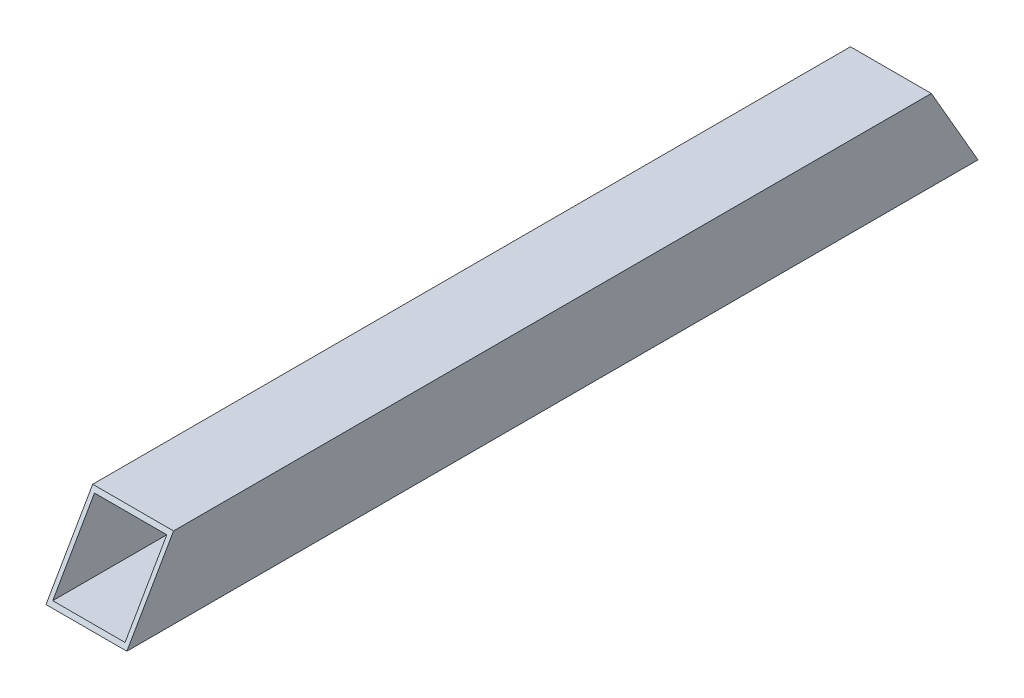
ISO-10303-21;
HEADER;
FILE_DESCRIPTION(('STEP AP214'),'2;1');
FILE_NAME('part.step','',(''),(''),'','','');
FILE_SCHEMA(('AUTOMOTIVE_DESIGN { 1 0 10303 214 1 1 1 1 }'));
ENDSEC;
DATA;
#1=APPLICATION_CONTEXT('core data for automotive mechanical design processes');
#2=APPLICATION_PROTOCOL_DEFINITION('international standard','automotive_design',2000,#1);
#3=PRODUCT_CONTEXT('',#1,'mechanical');
#4=PRODUCT('Part','Part','',(#3));
#5=PRODUCT_RELATED_PRODUCT_CATEGORY('part','',(#4));
#6=PRODUCT_DEFINITION_FORMATION('','',#4);
#7=PRODUCT_DEFINITION_CONTEXT('part definition',#1,'design');
#8=PRODUCT_DEFINITION('design','',#6,#7);
#9=PRODUCT_DEFINITION_SHAPE('','',#8);
#10=(LENGTH_UNIT() NAMED_UNIT(*) SI_UNIT(.MILLI.,.METRE.));
#11=(NAMED_UNIT(*) PLANE_ANGLE_UNIT() SI_UNIT($,.RADIAN.));
#12=(NAMED_UNIT(*) SI_UNIT($,.STERADIAN.) SOLID_ANGLE_UNIT());
#13=UNCERTAINTY_MEASURE_WITH_UNIT(LENGTH_MEASURE(1.E-05),#10,'distance_accuracy_value','');
#14=(GEOMETRIC_REPRESENTATION_CONTEXT(3) GLOBAL_UNCERTAINTY_ASSIGNED_CONTEXT((#13)) GLOBAL_UNIT_ASSIGNED_CONTEXT((#10,
#11,#12)) REPRESENTATION_CONTEXT('',''));
#15=CARTESIAN_POINT('',(0.,0.,0.));
#16=DIRECTION('',(0.,0.,1.));
#17=DIRECTION('',(1.,0.,0.));
#18=AXIS2_PLACEMENT_3D('',#15,#16,#17);
#19=CARTESIAN_POINT('',(9.5,-9.5,200.));
#20=DIRECTION('',(-1.,0.,0.));
#21=DIRECTION('',(0.,0.,1.));
#22=AXIS2_PLACEMENT_3D('',#19,#20,#21);
#23=PLANE('',#22);
#24=DIRECTION('',(0.,-0.866025403784436,-0.500000000000004));
#25=VECTOR('',#24,1.);
#26=CARTESIAN_POINT('',(9.5,77.1025403784444,50.0000000000009));
#27=LINE('',#26,#25);
#28=CARTESIAN_POINT('',(9.50000000000001,9.5,10.969655114603));
#29=VERTEX_POINT('',#28);
#30=CARTESIAN_POINT('',(9.5,-9.5,0.));
#31=VERTEX_POINT('',#30);
#32=EDGE_CURVE('E107',#29,#31,#27,.T.);
#33=ORIENTED_EDGE('',*,*,#32,.F.);
#34=DIRECTION('',(0.,0.,-1.));
#35=VECTOR('',#34,1.);
#36=CARTESIAN_POINT('',(9.5,9.5,200.));
#37=LINE('',#36,#35);
#38=CARTESIAN_POINT('',(9.5,9.5,189.030344885397));
#39=VERTEX_POINT('',#38);
#40=EDGE_CURVE('E43',#39,#29,#37,.T.);
#41=ORIENTED_EDGE('',*,*,#40,.F.);
#42=DIRECTION('',(0.,0.86602540378444,-0.499999999999998));
#43=VECTOR('',#42,1.);
#44=CARTESIAN_POINT('',(9.5,-9.5,200.));
#45=LINE('',#44,#43);
#46=CARTESIAN_POINT('',(9.50000000000001,-9.5,200.));
#47=VERTEX_POINT('',#46);
#48=EDGE_CURVE('E134',#47,#39,#45,.T.);
#49=ORIENTED_EDGE('',*,*,#48,.F.);
#50=DIRECTION('',(0.,0.,-1.));
#51=VECTOR('',#50,1.);
#52=CARTESIAN_POINT('',(9.5,-9.5,200.));
#53=LINE('',#52,#51);
#54=EDGE_CURVE('E125',#47,#31,#53,.T.);
#55=ORIENTED_EDGE('',*,*,#54,.T.);
#56=EDGE_LOOP('',(#33,#41,#49,#55));
#57=FACE_BOUND('',#56,.T.);
#58=ADVANCED_FACE('F36',(#57),#23,.F.);
#59=CARTESIAN_POINT('',(-9.5,9.5,200.));
#60=DIRECTION('',(0.,-1.,0.));
#61=DIRECTION('',(0.,0.,-1.));
#62=AXIS2_PLACEMENT_3D('',#59,#60,#61);
#63=PLANE('',#62);
#64=DIRECTION('',(1.,0.,0.));
#65=VECTOR('',#64,1.);
#66=CARTESIAN_POINT('',(-242.746159534689,9.5,10.969655114603));
#67=LINE('',#66,#65);
#68=CARTESIAN_POINT('',(-9.50000000000001,9.5,10.969655114603));
#69=VERTEX_POINT('',#68);
#70=EDGE_CURVE('E130',#69,#29,#67,.T.);
#71=ORIENTED_EDGE('',*,*,#70,.F.);
#72=DIRECTION('',(0.,0.,-1.));
#73=VECTOR('',#72,1.);
#74=CARTESIAN_POINT('',(-9.5,9.5,200.));
#75=LINE('',#74,#73);
#76=CARTESIAN_POINT('',(-9.5,9.50000000000001,189.030344885397));
#77=VERTEX_POINT('',#76);
#78=EDGE_CURVE('E119',#77,#69,#75,.T.);
#79=ORIENTED_EDGE('',*,*,#78,.F.);
#80=DIRECTION('',(-1.,0.,0.));
#81=VECTOR('',#80,1.);
#82=CARTESIAN_POINT('',(261.746159534689,9.5,189.030344885397));
#83=LINE('',#82,#81);
#84=EDGE_CURVE('E58',#39,#77,#83,.T.);
#85=ORIENTED_EDGE('',*,*,#84,.F.);
#86=ORIENTED_EDGE('',*,*,#40,.T.);
#87=EDGE_LOOP('',(#71,#79,#85,#86));
#88=FACE_BOUND('',#87,.T.);
#89=ADVANCED_FACE('F129',(#88),#63,.F.);
#90=CARTESIAN_POINT('',(-9.5,-9.5,200.));
#91=DIRECTION('',(1.,0.,0.));
#92=DIRECTION('',(0.,0.,-1.));
#93=AXIS2_PLACEMENT_3D('',#90,#91,#92);
#94=PLANE('',#93);
#95=DIRECTION('',(0.,0.866025403784436,0.500000000000004));
#96=VECTOR('',#95,1.);
#97=CARTESIAN_POINT('',(-9.5,77.1025403784444,50.0000000000009));
#98=LINE('',#97,#96);
#99=CARTESIAN_POINT('',(-9.50000000000001,-9.5,0.));
#100=VERTEX_POINT('',#99);
#101=EDGE_CURVE('E104',#100,#69,#98,.T.);
#102=ORIENTED_EDGE('',*,*,#101,.F.);
#103=DIRECTION('',(0.,0.,-1.));
#104=VECTOR('',#103,1.);
#105=CARTESIAN_POINT('',(-9.5,-9.5,200.));
#106=LINE('',#105,#104);
#107=CARTESIAN_POINT('',(-9.5,-9.5,200.));
#108=VERTEX_POINT('',#107);
#109=EDGE_CURVE('E117',#108,#100,#106,.T.);
#110=ORIENTED_EDGE('',*,*,#109,.F.);
#111=DIRECTION('',(0.,-0.86602540378444,0.499999999999998));
#112=VECTOR('',#111,1.);
#113=CARTESIAN_POINT('',(-9.5,-9.5,200.));
#114=LINE('',#113,#112);
#115=EDGE_CURVE('E138',#77,#108,#114,.T.);
#116=ORIENTED_EDGE('',*,*,#115,.F.);
#117=ORIENTED_EDGE('',*,*,#78,.T.);
#118=EDGE_LOOP('',(#102,#110,#116,#117));
#119=FACE_BOUND('',#118,.T.);
#120=ADVANCED_FACE('F116',(#119),#94,.F.);
#121=CARTESIAN_POINT('',(-8.5,-8.5,200.));
#122=DIRECTION('',(1.,0.,0.));
#123=DIRECTION('',(0.,0.,-1.));
#124=AXIS2_PLACEMENT_3D('',#121,#122,#123);
#125=PLANE('',#124);
#126=DIRECTION('',(0.,0.,-1.));
#127=VECTOR('',#126,1.);
#128=CARTESIAN_POINT('',(-8.5,-8.5,200.));
#129=LINE('',#128,#127);
#130=CARTESIAN_POINT('',(-8.5,-8.5,199.42264973081));
#131=VERTEX_POINT('',#130);
#132=CARTESIAN_POINT('',(-8.5,-8.5,0.577350269189647));
#133=VERTEX_POINT('',#132);
#134=EDGE_CURVE('E112',#131,#133,#129,.T.);
#135=ORIENTED_EDGE('',*,*,#134,.T.);
#136=DIRECTION('',(0.,0.866025403784436,0.500000000000004));
#137=VECTOR('',#136,1.);
#138=CARTESIAN_POINT('',(-8.5,77.8525403784444,50.4330127018931));
#139=LINE('',#138,#137);
#140=CARTESIAN_POINT('',(-8.5,8.5,10.3923048454134));
#141=VERTEX_POINT('',#140);
#142=EDGE_CURVE('E120',#133,#141,#139,.T.);
#143=ORIENTED_EDGE('',*,*,#142,.T.);
#144=DIRECTION('',(0.,0.,-1.));
#145=VECTOR('',#144,1.);
#146=CARTESIAN_POINT('',(-8.5,8.5,200.));
#147=LINE('',#146,#145);
#148=CARTESIAN_POINT('',(-8.5,8.5,189.607695154587));
#149=VERTEX_POINT('',#148);
#150=EDGE_CURVE('E137',#149,#141,#147,.T.);
#151=ORIENTED_EDGE('',*,*,#150,.F.);
#152=DIRECTION('',(0.,-0.86602540378444,0.499999999999998));
#153=VECTOR('',#152,1.);
#154=CARTESIAN_POINT('',(-8.5,-8.75,199.566987298108));
#155=LINE('',#154,#153);
#156=EDGE_CURVE('E143',#149,#131,#155,.T.);
#157=ORIENTED_EDGE('',*,*,#156,.T.);
#158=EDGE_LOOP('',(#135,#143,#151,#157));
#159=FACE_BOUND('',#158,.T.);
#160=ADVANCED_FACE('F158',(#159),#125,.T.);
#161=CARTESIAN_POINT('',(-8.5,-8.5,200.));
#162=DIRECTION('',(0.,1.,0.));
#163=DIRECTION('',(0.,0.,1.));
#164=AXIS2_PLACEMENT_3D('',#161,#162,#163);
#165=PLANE('',#164);
#166=DIRECTION('',(0.,0.,-1.));
#167=VECTOR('',#166,1.);
#168=CARTESIAN_POINT('',(8.5,-8.5,200.));
#169=LINE('',#168,#167);
#170=CARTESIAN_POINT('',(8.5,-8.5,199.42264973081));
#171=VERTEX_POINT('',#170);
#172=CARTESIAN_POINT('',(8.5,-8.49999999999999,0.57735026918964));
#173=VERTEX_POINT('',#172);
#174=EDGE_CURVE('E149',#171,#173,#169,.T.);
#175=ORIENTED_EDGE('',*,*,#174,.T.);
#176=DIRECTION('',(-1.,0.,0.));
#177=VECTOR('',#176,1.);
#178=CARTESIAN_POINT('',(-8.5,-8.5,0.577350269189647));
#179=LINE('',#178,#177);
#180=EDGE_CURVE('E166',#173,#133,#179,.T.);
#181=ORIENTED_EDGE('',*,*,#180,.T.);
#182=ORIENTED_EDGE('',*,*,#134,.F.);
#183=DIRECTION('',(1.,0.,0.));
#184=VECTOR('',#183,1.);
#185=CARTESIAN_POINT('',(-8.5,-8.5,199.42264973081));
#186=LINE('',#185,#184);
#187=EDGE_CURVE('E164',#131,#171,#186,.T.);
#188=ORIENTED_EDGE('',*,*,#187,.T.);
#189=EDGE_LOOP('',(#175,#181,#182,#188));
#190=FACE_BOUND('',#189,.T.);
#191=ADVANCED_FACE('F163',(#190),#165,.T.);
#192=CARTESIAN_POINT('',(8.5,-8.5,200.));
#193=DIRECTION('',(-1.,0.,0.));
#194=DIRECTION('',(0.,-1.,0.));
#195=AXIS2_PLACEMENT_3D('',#192,#193,#194);
#196=PLANE('',#195);
#197=DIRECTION('',(0.,0.,-1.));
#198=VECTOR('',#197,1.);
#199=CARTESIAN_POINT('',(8.5,8.5,200.));
#200=LINE('',#199,#198);
#201=CARTESIAN_POINT('',(8.5,8.5,189.607695154587));
#202=VERTEX_POINT('',#201);
#203=CARTESIAN_POINT('',(8.5,8.5,10.3923048454134));
#204=VERTEX_POINT('',#203);
#205=EDGE_CURVE('E141',#202,#204,#200,.T.);
#206=ORIENTED_EDGE('',*,*,#205,.T.);
#207=DIRECTION('',(0.,-0.866025403784436,-0.500000000000004));
#208=VECTOR('',#207,1.);
#209=CARTESIAN_POINT('',(8.49999999999999,77.8525403784444,50.4330127018931));
#210=LINE('',#209,#208);
#211=EDGE_CURVE('E50',#204,#173,#210,.T.);
#212=ORIENTED_EDGE('',*,*,#211,.T.);
#213=ORIENTED_EDGE('',*,*,#174,.F.);
#214=DIRECTION('',(0.,0.86602540378444,-0.499999999999998));
#215=VECTOR('',#214,1.);
#216=CARTESIAN_POINT('',(8.5,-8.75,199.566987298108));
#217=LINE('',#216,#215);
#218=EDGE_CURVE('E175',#171,#202,#217,.T.);
#219=ORIENTED_EDGE('',*,*,#218,.T.);
#220=EDGE_LOOP('',(#206,#212,#213,#219));
#221=FACE_BOUND('',#220,.T.);
#222=ADVANCED_FACE('F180',(#221),#196,.T.);
#223=CARTESIAN_POINT('',(-8.5,8.5,200.));
#224=DIRECTION('',(0.,-1.,0.));
#225=DIRECTION('',(0.,0.,-1.));
#226=AXIS2_PLACEMENT_3D('',#223,#224,#225);
#227=PLANE('',#226);
#228=ORIENTED_EDGE('',*,*,#150,.T.);
#229=DIRECTION('',(1.,0.,0.));
#230=VECTOR('',#229,1.);
#231=CARTESIAN_POINT('',(-8.5,8.5,10.3923048454134));
#232=LINE('',#231,#230);
#233=EDGE_CURVE('E169',#141,#204,#232,.T.);
#234=ORIENTED_EDGE('',*,*,#233,.T.);
#235=ORIENTED_EDGE('',*,*,#205,.F.);
#236=DIRECTION('',(-1.,0.,0.));
#237=VECTOR('',#236,1.);
#238=CARTESIAN_POINT('',(-8.5,8.5,189.607695154587));
#239=LINE('',#238,#237);
#240=EDGE_CURVE('E11',#202,#149,#239,.T.);
#241=ORIENTED_EDGE('',*,*,#240,.T.);
#242=EDGE_LOOP('',(#228,#234,#235,#241));
#243=FACE_BOUND('',#242,.T.);
#244=ADVANCED_FACE('F183',(#243),#227,.T.);
#245=CARTESIAN_POINT('',(-9.5,-9.5,200.));
#246=DIRECTION('',(0.,1.,0.));
#247=DIRECTION('',(0.,0.,1.));
#248=AXIS2_PLACEMENT_3D('',#245,#246,#247);
#249=PLANE('',#248);
#250=DIRECTION('',(1.,0.,0.));
#251=VECTOR('',#250,1.);
#252=CARTESIAN_POINT('',(-9.5,-9.5,0.));
#253=LINE('',#252,#251);
#254=EDGE_CURVE('E101',#100,#31,#253,.T.);
#255=ORIENTED_EDGE('',*,*,#254,.T.);
#256=ORIENTED_EDGE('',*,*,#54,.F.);
#257=DIRECTION('',(1.,0.,0.));
#258=VECTOR('',#257,1.);
#259=CARTESIAN_POINT('',(-9.5,-9.5,200.));
#260=LINE('',#259,#258);
#261=EDGE_CURVE('E111',#108,#47,#260,.T.);
#262=ORIENTED_EDGE('',*,*,#261,.F.);
#263=ORIENTED_EDGE('',*,*,#109,.T.);
#264=EDGE_LOOP('',(#255,#256,#262,#263));
#265=FACE_BOUND('',#264,.T.);
#266=ADVANCED_FACE('F122',(#265),#249,.F.);
#267=CARTESIAN_POINT('',(261.746159534689,-9.5,200.));
#268=DIRECTION('',(0.,0.499999999999998,0.86602540378444));
#269=DIRECTION('',(0.,-0.86602540378444,0.499999999999998));
#270=AXIS2_PLACEMENT_3D('',#267,#268,#269);
#271=PLANE('',#270);
#272=ORIENTED_EDGE('',*,*,#156,.F.);
#273=ORIENTED_EDGE('',*,*,#240,.F.);
#274=ORIENTED_EDGE('',*,*,#218,.F.);
#275=ORIENTED_EDGE('',*,*,#187,.F.);
#276=EDGE_LOOP('',(#272,#273,#274,#275));
#277=FACE_BOUND('',#276,.T.);
#278=ORIENTED_EDGE('',*,*,#261,.T.);
#279=ORIENTED_EDGE('',*,*,#48,.T.);
#280=ORIENTED_EDGE('',*,*,#84,.T.);
#281=ORIENTED_EDGE('',*,*,#115,.T.);
#282=EDGE_LOOP('',(#278,#279,#280,#281));
#283=FACE_BOUND('',#282,.T.);
#284=ADVANCED_FACE('F136',(#277,#283),#271,.T.);
#285=CARTESIAN_POINT('',(-242.746159534689,-9.5,0.));
#286=DIRECTION('',(0.,0.500000000000004,-0.866025403784436));
#287=DIRECTION('',(0.,0.866025403784436,0.500000000000004));
#288=AXIS2_PLACEMENT_3D('',#285,#286,#287);
#289=PLANE('',#288);
#290=ORIENTED_EDGE('',*,*,#142,.F.);
#291=ORIENTED_EDGE('',*,*,#180,.F.);
#292=ORIENTED_EDGE('',*,*,#211,.F.);
#293=ORIENTED_EDGE('',*,*,#233,.F.);
#294=EDGE_LOOP('',(#290,#291,#292,#293));
#295=FACE_BOUND('',#294,.T.);
#296=ORIENTED_EDGE('',*,*,#70,.T.);
#297=ORIENTED_EDGE('',*,*,#32,.T.);
#298=ORIENTED_EDGE('',*,*,#254,.F.);
#299=ORIENTED_EDGE('',*,*,#101,.T.);
#300=EDGE_LOOP('',(#296,#297,#298,#299));
#301=FACE_BOUND('',#300,.T.);
#302=ADVANCED_FACE('F103',(#295,#301),#289,.T.);
#303=CLOSED_SHELL('',(#58,#89,#120,#160,#191,#222,#244,#266,#284,#302));
#304=MANIFOLD_SOLID_BREP('B2',#303);
#305=ADVANCED_BREP_SHAPE_REPRESENTATION('',(#18,#304),#14);
#306=SHAPE_DEFINITION_REPRESENTATION(#9,#305);
ENDSEC;
END-ISO-10303-21;
